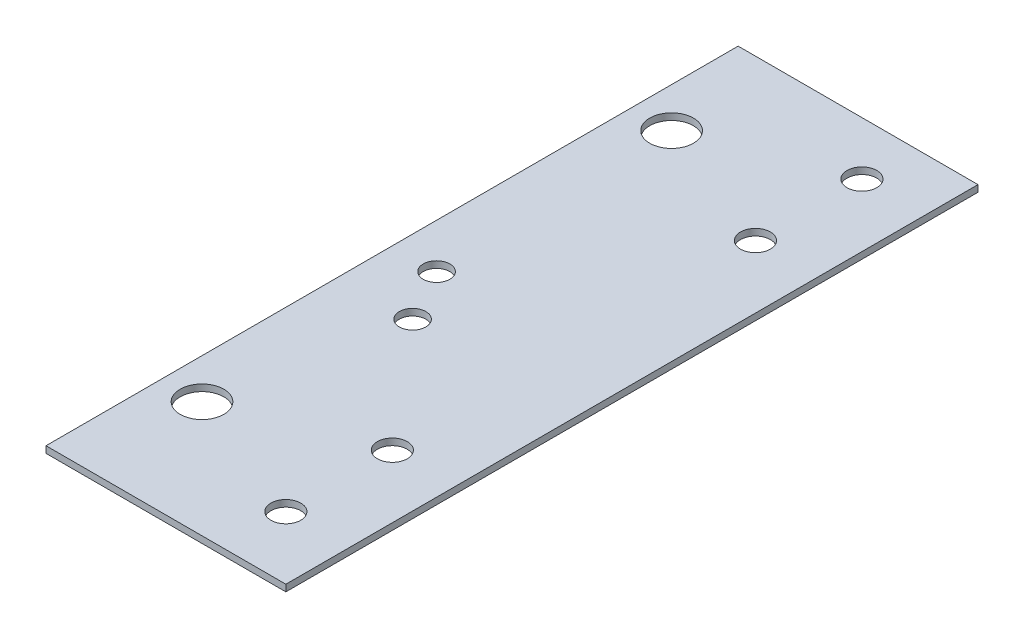
ISO-10303-21;
HEADER;
FILE_DESCRIPTION(('STEP AP214'),'2;1');
FILE_NAME('part.step','',(''),(''),'','','');
FILE_SCHEMA(('AUTOMOTIVE_DESIGN { 1 0 10303 214 1 1 1 1 }'));
ENDSEC;
DATA;
#1=APPLICATION_CONTEXT('core data for automotive mechanical design processes');
#2=APPLICATION_PROTOCOL_DEFINITION('international standard','automotive_design',2000,#1);
#3=PRODUCT_CONTEXT('',#1,'mechanical');
#4=PRODUCT('Part','Part','',(#3));
#5=PRODUCT_RELATED_PRODUCT_CATEGORY('part','',(#4));
#6=PRODUCT_DEFINITION_FORMATION('','',#4);
#7=PRODUCT_DEFINITION_CONTEXT('part definition',#1,'design');
#8=PRODUCT_DEFINITION('design','',#6,#7);
#9=PRODUCT_DEFINITION_SHAPE('','',#8);
#10=(LENGTH_UNIT() NAMED_UNIT(*) SI_UNIT(.MILLI.,.METRE.));
#11=(NAMED_UNIT(*) PLANE_ANGLE_UNIT() SI_UNIT($,.RADIAN.));
#12=(NAMED_UNIT(*) SI_UNIT($,.STERADIAN.) SOLID_ANGLE_UNIT());
#13=UNCERTAINTY_MEASURE_WITH_UNIT(LENGTH_MEASURE(1.E-05),#10,'distance_accuracy_value','');
#14=(GEOMETRIC_REPRESENTATION_CONTEXT(3) GLOBAL_UNCERTAINTY_ASSIGNED_CONTEXT((#13)) GLOBAL_UNIT_ASSIGNED_CONTEXT((#10,
#11,#12)) REPRESENTATION_CONTEXT('',''));
#15=CARTESIAN_POINT('',(0.,0.,0.));
#16=DIRECTION('',(0.,0.,1.));
#17=DIRECTION('',(1.,0.,0.));
#18=AXIS2_PLACEMENT_3D('',#15,#16,#17);
#19=CARTESIAN_POINT('',(0.,1.5875,0.));
#20=DIRECTION('',(0.,-1.,0.));
#21=DIRECTION('',(0.,0.,-1.));
#22=AXIS2_PLACEMENT_3D('',#19,#20,#21);
#23=PLANE('',#22);
#24=CARTESIAN_POINT('',(-11.01725,1.5875,13.843));
#25=DIRECTION('',(0.,-1.,0.));
#26=DIRECTION('',(0.,0.,-1.));
#27=AXIS2_PLACEMENT_3D('',#24,#25,#26);
#28=CIRCLE('',#27,3.175);
#29=CARTESIAN_POINT('',(-11.01725,1.5875,10.668));
#30=VERTEX_POINT('',#29);
#31=EDGE_CURVE('E318',#30,#30,#28,.T.);
#32=ORIENTED_EDGE('',*,*,#31,.T.);
#33=EDGE_LOOP('',(#32));
#34=FACE_BOUND('',#33,.T.);
#35=CARTESIAN_POINT('',(-17.992815678,1.5875,1.143));
#36=DIRECTION('',(0.,1.,0.));
#37=DIRECTION('',(0.,0.,1.));
#38=AXIS2_PLACEMENT_3D('',#35,#36,#37);
#39=CIRCLE('',#38,3.175);
#40=CARTESIAN_POINT('',(-17.992815678,1.5875,4.318));
#41=VERTEX_POINT('',#40);
#42=EDGE_CURVE('E136',#41,#41,#39,.T.);
#43=ORIENTED_EDGE('',*,*,#42,.F.);
#44=EDGE_LOOP('',(#43));
#45=FACE_BOUND('',#44,.T.);
#46=DIRECTION('',(0.,0.,-1.));
#47=VECTOR('',#46,1.);
#48=CARTESIAN_POINT('',(28.60675,1.5875,83.693));
#49=LINE('',#48,#47);
#50=CARTESIAN_POINT('',(28.60675,1.5875,83.693));
#51=VERTEX_POINT('',#50);
#52=CARTESIAN_POINT('',(28.60675,1.5875,-81.407));
#53=VERTEX_POINT('',#52);
#54=EDGE_CURVE('E82',#51,#53,#49,.T.);
#55=ORIENTED_EDGE('',*,*,#54,.T.);
#56=DIRECTION('',(-1.,0.,0.));
#57=VECTOR('',#56,1.);
#58=CARTESIAN_POINT('',(-28.60675,1.5875,-81.407));
#59=LINE('',#58,#57);
#60=CARTESIAN_POINT('',(-28.60675,1.5875,-81.407));
#61=VERTEX_POINT('',#60);
#62=EDGE_CURVE('E85',#53,#61,#59,.T.);
#63=ORIENTED_EDGE('',*,*,#62,.T.);
#64=DIRECTION('',(0.,0.,1.));
#65=VECTOR('',#64,1.);
#66=CARTESIAN_POINT('',(-28.60675,1.5875,-81.407));
#67=LINE('',#66,#65);
#68=CARTESIAN_POINT('',(-28.60675,1.5875,83.693));
#69=VERTEX_POINT('',#68);
#70=EDGE_CURVE('E89',#61,#69,#67,.T.);
#71=ORIENTED_EDGE('',*,*,#70,.T.);
#72=DIRECTION('',(1.,0.,0.));
#73=VECTOR('',#72,1.);
#74=CARTESIAN_POINT('',(-28.60675,1.5875,83.693));
#75=LINE('',#74,#73);
#76=EDGE_CURVE('E54',#69,#51,#75,.T.);
#77=ORIENTED_EDGE('',*,*,#76,.T.);
#78=EDGE_LOOP('',(#55,#63,#71,#77));
#79=FACE_BOUND('',#78,.T.);
#80=CARTESIAN_POINT('',(-19.08175,1.5875,-56.007));
#81=DIRECTION('',(0.,1.,0.));
#82=DIRECTION('',(0.,0.,1.));
#83=AXIS2_PLACEMENT_3D('',#80,#81,#82);
#84=CIRCLE('',#83,5.207);
#85=CARTESIAN_POINT('',(-19.08175,1.5875,-50.8));
#86=VERTEX_POINT('',#85);
#87=EDGE_CURVE('E103',#86,#86,#84,.T.);
#88=ORIENTED_EDGE('',*,*,#87,.F.);
#89=EDGE_LOOP('',(#88));
#90=FACE_BOUND('',#89,.T.);
#91=CARTESIAN_POINT('',(-19.08175,1.5875,56.007));
#92=DIRECTION('',(0.,1.,0.));
#93=DIRECTION('',(0.,0.,1.));
#94=AXIS2_PLACEMENT_3D('',#91,#92,#93);
#95=CIRCLE('',#94,5.207);
#96=CARTESIAN_POINT('',(-19.08175,1.5875,61.214));
#97=VERTEX_POINT('',#96);
#98=EDGE_CURVE('E155',#97,#97,#95,.T.);
#99=ORIENTED_EDGE('',*,*,#98,.F.);
#100=EDGE_LOOP('',(#99));
#101=FACE_BOUND('',#100,.T.);
#102=CARTESIAN_POINT('',(13.62075,1.5875,-68.707));
#103=DIRECTION('',(0.,1.,0.));
#104=DIRECTION('',(0.,0.,1.));
#105=AXIS2_PLACEMENT_3D('',#102,#103,#104);
#106=CIRCLE('',#105,3.55600000000001);
#107=CARTESIAN_POINT('',(13.62075,1.5875,-65.151));
#108=VERTEX_POINT('',#107);
#109=EDGE_CURVE('E150',#108,#108,#106,.T.);
#110=ORIENTED_EDGE('',*,*,#109,.F.);
#111=EDGE_LOOP('',(#110));
#112=FACE_BOUND('',#111,.T.);
#113=CARTESIAN_POINT('',(13.62075,1.5875,-43.307));
#114=DIRECTION('',(0.,1.,0.));
#115=DIRECTION('',(0.,0.,1.));
#116=AXIS2_PLACEMENT_3D('',#113,#114,#115);
#117=CIRCLE('',#116,3.55600000000001);
#118=CARTESIAN_POINT('',(13.62075,1.5875,-39.751));
#119=VERTEX_POINT('',#118);
#120=EDGE_CURVE('E145',#119,#119,#117,.T.);
#121=ORIENTED_EDGE('',*,*,#120,.F.);
#122=EDGE_LOOP('',(#121));
#123=FACE_BOUND('',#122,.T.);
#124=CARTESIAN_POINT('',(13.62075,1.5875,43.307));
#125=DIRECTION('',(0.,1.,0.));
#126=DIRECTION('',(0.,0.,1.));
#127=AXIS2_PLACEMENT_3D('',#124,#125,#126);
#128=CIRCLE('',#127,3.55600000000001);
#129=CARTESIAN_POINT('',(13.62075,1.5875,46.863));
#130=VERTEX_POINT('',#129);
#131=EDGE_CURVE('E140',#130,#130,#128,.T.);
#132=ORIENTED_EDGE('',*,*,#131,.F.);
#133=EDGE_LOOP('',(#132));
#134=FACE_BOUND('',#133,.T.);
#135=CARTESIAN_POINT('',(13.62075,1.5875,68.707));
#136=DIRECTION('',(0.,1.,0.));
#137=DIRECTION('',(0.,0.,1.));
#138=AXIS2_PLACEMENT_3D('',#135,#136,#137);
#139=CIRCLE('',#138,3.55600000000001);
#140=CARTESIAN_POINT('',(13.62075,1.5875,72.263));
#141=VERTEX_POINT('',#140);
#142=EDGE_CURVE('E129',#141,#141,#139,.T.);
#143=ORIENTED_EDGE('',*,*,#142,.F.);
#144=EDGE_LOOP('',(#143));
#145=FACE_BOUND('',#144,.T.);
#146=ADVANCED_FACE('F37',(#34,#45,#79,#90,#101,#112,#123,#134,#145),#23,.F.);
#147=CARTESIAN_POINT('',(0.,0.,0.));
#148=DIRECTION('',(0.,-1.,0.));
#149=DIRECTION('',(0.,0.,-1.));
#150=AXIS2_PLACEMENT_3D('',#147,#148,#149);
#151=PLANE('',#150);
#152=CARTESIAN_POINT('',(-11.01725,0.,13.843));
#153=DIRECTION('',(0.,-1.,0.));
#154=DIRECTION('',(0.,0.,-1.));
#155=AXIS2_PLACEMENT_3D('',#152,#153,#154);
#156=CIRCLE('',#155,3.175);
#157=CARTESIAN_POINT('',(-11.01725,0.,10.668));
#158=VERTEX_POINT('',#157);
#159=EDGE_CURVE('E319',#158,#158,#156,.T.);
#160=ORIENTED_EDGE('',*,*,#159,.F.);
#161=EDGE_LOOP('',(#160));
#162=FACE_BOUND('',#161,.T.);
#163=CARTESIAN_POINT('',(-17.992815678,0.,1.143));
#164=DIRECTION('',(0.,1.,0.));
#165=DIRECTION('',(0.,0.,1.));
#166=AXIS2_PLACEMENT_3D('',#163,#164,#165);
#167=CIRCLE('',#166,3.175);
#168=CARTESIAN_POINT('',(-17.992815678,0.,4.318));
#169=VERTEX_POINT('',#168);
#170=EDGE_CURVE('E130',#169,#169,#167,.T.);
#171=ORIENTED_EDGE('',*,*,#170,.T.);
#172=EDGE_LOOP('',(#171));
#173=FACE_BOUND('',#172,.T.);
#174=CARTESIAN_POINT('',(13.62075,0.,43.307));
#175=DIRECTION('',(0.,1.,0.));
#176=DIRECTION('',(0.,0.,1.));
#177=AXIS2_PLACEMENT_3D('',#174,#175,#176);
#178=CIRCLE('',#177,3.55600000000001);
#179=CARTESIAN_POINT('',(13.62075,0.,46.863));
#180=VERTEX_POINT('',#179);
#181=EDGE_CURVE('E133',#180,#180,#178,.T.);
#182=ORIENTED_EDGE('',*,*,#181,.T.);
#183=EDGE_LOOP('',(#182));
#184=FACE_BOUND('',#183,.T.);
#185=CARTESIAN_POINT('',(13.62075,0.,-68.707));
#186=DIRECTION('',(0.,1.,0.));
#187=DIRECTION('',(0.,0.,1.));
#188=AXIS2_PLACEMENT_3D('',#185,#186,#187);
#189=CIRCLE('',#188,3.55600000000001);
#190=CARTESIAN_POINT('',(13.62075,0.,-65.151));
#191=VERTEX_POINT('',#190);
#192=EDGE_CURVE('E148',#191,#191,#189,.T.);
#193=ORIENTED_EDGE('',*,*,#192,.T.);
#194=EDGE_LOOP('',(#193));
#195=FACE_BOUND('',#194,.T.);
#196=CARTESIAN_POINT('',(-19.08175,0.,-56.007));
#197=DIRECTION('',(0.,1.,0.));
#198=DIRECTION('',(0.,0.,1.));
#199=AXIS2_PLACEMENT_3D('',#196,#197,#198);
#200=CIRCLE('',#199,5.207);
#201=CARTESIAN_POINT('',(-19.08175,0.,-50.8));
#202=VERTEX_POINT('',#201);
#203=EDGE_CURVE('E158',#202,#202,#200,.T.);
#204=ORIENTED_EDGE('',*,*,#203,.T.);
#205=EDGE_LOOP('',(#204));
#206=FACE_BOUND('',#205,.T.);
#207=DIRECTION('',(0.,0.,-1.));
#208=VECTOR('',#207,1.);
#209=CARTESIAN_POINT('',(28.60675,0.,-81.407));
#210=LINE('',#209,#208);
#211=CARTESIAN_POINT('',(28.60675,0.,83.693));
#212=VERTEX_POINT('',#211);
#213=CARTESIAN_POINT('',(28.60675,0.,-81.407));
#214=VERTEX_POINT('',#213);
#215=EDGE_CURVE('E77',#212,#214,#210,.T.);
#216=ORIENTED_EDGE('',*,*,#215,.F.);
#217=DIRECTION('',(1.,0.,0.));
#218=VECTOR('',#217,1.);
#219=CARTESIAN_POINT('',(-28.60675,0.,83.693));
#220=LINE('',#219,#218);
#221=CARTESIAN_POINT('',(-28.60675,0.,83.693));
#222=VERTEX_POINT('',#221);
#223=EDGE_CURVE('E106',#222,#212,#220,.T.);
#224=ORIENTED_EDGE('',*,*,#223,.F.);
#225=DIRECTION('',(0.,0.,1.));
#226=VECTOR('',#225,1.);
#227=CARTESIAN_POINT('',(-28.60675,0.,81.407));
#228=LINE('',#227,#226);
#229=CARTESIAN_POINT('',(-28.60675,0.,-81.407));
#230=VERTEX_POINT('',#229);
#231=EDGE_CURVE('E70',#230,#222,#228,.T.);
#232=ORIENTED_EDGE('',*,*,#231,.F.);
#233=DIRECTION('',(-1.,0.,0.));
#234=VECTOR('',#233,1.);
#235=CARTESIAN_POINT('',(-28.60675,0.,-81.407));
#236=LINE('',#235,#234);
#237=EDGE_CURVE('E94',#214,#230,#236,.T.);
#238=ORIENTED_EDGE('',*,*,#237,.F.);
#239=EDGE_LOOP('',(#216,#224,#232,#238));
#240=FACE_BOUND('',#239,.T.);
#241=CARTESIAN_POINT('',(-19.08175,0.,56.007));
#242=DIRECTION('',(0.,1.,0.));
#243=DIRECTION('',(0.,0.,1.));
#244=AXIS2_PLACEMENT_3D('',#241,#242,#243);
#245=CIRCLE('',#244,5.207);
#246=CARTESIAN_POINT('',(-19.08175,0.,61.214));
#247=VERTEX_POINT('',#246);
#248=EDGE_CURVE('E120',#247,#247,#245,.T.);
#249=ORIENTED_EDGE('',*,*,#248,.T.);
#250=EDGE_LOOP('',(#249));
#251=FACE_BOUND('',#250,.T.);
#252=CARTESIAN_POINT('',(13.62075,0.,-43.307));
#253=DIRECTION('',(0.,1.,0.));
#254=DIRECTION('',(0.,0.,1.));
#255=AXIS2_PLACEMENT_3D('',#252,#253,#254);
#256=CIRCLE('',#255,3.55600000000001);
#257=CARTESIAN_POINT('',(13.62075,0.,-39.751));
#258=VERTEX_POINT('',#257);
#259=EDGE_CURVE('E124',#258,#258,#256,.T.);
#260=ORIENTED_EDGE('',*,*,#259,.T.);
#261=EDGE_LOOP('',(#260));
#262=FACE_BOUND('',#261,.T.);
#263=CARTESIAN_POINT('',(13.62075,0.,68.707));
#264=DIRECTION('',(0.,1.,0.));
#265=DIRECTION('',(0.,0.,1.));
#266=AXIS2_PLACEMENT_3D('',#263,#264,#265);
#267=CIRCLE('',#266,3.55600000000001);
#268=CARTESIAN_POINT('',(13.62075,0.,72.263));
#269=VERTEX_POINT('',#268);
#270=EDGE_CURVE('E127',#269,#269,#267,.T.);
#271=ORIENTED_EDGE('',*,*,#270,.T.);
#272=EDGE_LOOP('',(#271));
#273=FACE_BOUND('',#272,.T.);
#274=ADVANCED_FACE('F112',(#162,#173,#184,#195,#206,#240,#251,#262,#273),#151,.T.);
#275=CARTESIAN_POINT('',(28.60675,1.5875,-81.407));
#276=DIRECTION('',(-1.,0.,0.));
#277=DIRECTION('',(0.,0.,1.));
#278=AXIS2_PLACEMENT_3D('',#275,#276,#277);
#279=PLANE('',#278);
#280=ORIENTED_EDGE('',*,*,#215,.T.);
#281=DIRECTION('',(0.,-1.,0.));
#282=VECTOR('',#281,1.);
#283=CARTESIAN_POINT('',(28.60675,1.5875,-81.407));
#284=LINE('',#283,#282);
#285=EDGE_CURVE('E11',#53,#214,#284,.T.);
#286=ORIENTED_EDGE('',*,*,#285,.F.);
#287=ORIENTED_EDGE('',*,*,#54,.F.);
#288=DIRECTION('',(0.,-1.,0.));
#289=VECTOR('',#288,1.);
#290=CARTESIAN_POINT('',(28.60675,1.5875,83.693));
#291=LINE('',#290,#289);
#292=EDGE_CURVE('E98',#51,#212,#291,.T.);
#293=ORIENTED_EDGE('',*,*,#292,.T.);
#294=EDGE_LOOP('',(#280,#286,#287,#293));
#295=FACE_BOUND('',#294,.T.);
#296=ADVANCED_FACE('F39',(#295),#279,.F.);
#297=CARTESIAN_POINT('',(-28.60675,1.5875,-81.407));
#298=DIRECTION('',(0.,0.,1.));
#299=DIRECTION('',(1.,0.,0.));
#300=AXIS2_PLACEMENT_3D('',#297,#298,#299);
#301=PLANE('',#300);
#302=ORIENTED_EDGE('',*,*,#237,.T.);
#303=DIRECTION('',(0.,-1.,0.));
#304=VECTOR('',#303,1.);
#305=CARTESIAN_POINT('',(-28.60675,1.5875,-81.407));
#306=LINE('',#305,#304);
#307=EDGE_CURVE('E46',#61,#230,#306,.T.);
#308=ORIENTED_EDGE('',*,*,#307,.F.);
#309=ORIENTED_EDGE('',*,*,#62,.F.);
#310=ORIENTED_EDGE('',*,*,#285,.T.);
#311=EDGE_LOOP('',(#302,#308,#309,#310));
#312=FACE_BOUND('',#311,.T.);
#313=ADVANCED_FACE('F93',(#312),#301,.F.);
#314=CARTESIAN_POINT('',(-28.60675,1.5875,81.407));
#315=DIRECTION('',(1.,0.,0.));
#316=DIRECTION('',(0.,0.,-1.));
#317=AXIS2_PLACEMENT_3D('',#314,#315,#316);
#318=PLANE('',#317);
#319=ORIENTED_EDGE('',*,*,#231,.T.);
#320=DIRECTION('',(0.,-1.,0.));
#321=VECTOR('',#320,1.);
#322=CARTESIAN_POINT('',(-28.60675,1.5875,83.693));
#323=LINE('',#322,#321);
#324=EDGE_CURVE('E95',#69,#222,#323,.T.);
#325=ORIENTED_EDGE('',*,*,#324,.F.);
#326=ORIENTED_EDGE('',*,*,#70,.F.);
#327=ORIENTED_EDGE('',*,*,#307,.T.);
#328=EDGE_LOOP('',(#319,#325,#326,#327));
#329=FACE_BOUND('',#328,.T.);
#330=ADVANCED_FACE('F96',(#329),#318,.F.);
#331=CARTESIAN_POINT('',(-28.60675,1.5875,83.693));
#332=DIRECTION('',(0.,0.,-1.));
#333=DIRECTION('',(-1.,0.,0.));
#334=AXIS2_PLACEMENT_3D('',#331,#332,#333);
#335=PLANE('',#334);
#336=ORIENTED_EDGE('',*,*,#223,.T.);
#337=ORIENTED_EDGE('',*,*,#292,.F.);
#338=ORIENTED_EDGE('',*,*,#76,.F.);
#339=ORIENTED_EDGE('',*,*,#324,.T.);
#340=EDGE_LOOP('',(#336,#337,#338,#339));
#341=FACE_BOUND('',#340,.T.);
#342=ADVANCED_FACE('F111',(#341),#335,.F.);
#343=CARTESIAN_POINT('',(-19.08175,1.5875,-56.007));
#344=DIRECTION('',(0.,-1.,0.));
#345=DIRECTION('',(0.,0.,-1.));
#346=AXIS2_PLACEMENT_3D('',#343,#344,#345);
#347=CYLINDRICAL_SURFACE('',#346,5.207);
#348=ORIENTED_EDGE('',*,*,#87,.T.);
#349=EDGE_LOOP('',(#348));
#350=FACE_BOUND('',#349,.T.);
#351=ORIENTED_EDGE('',*,*,#203,.F.);
#352=EDGE_LOOP('',(#351));
#353=FACE_BOUND('',#352,.T.);
#354=ADVANCED_FACE('F166',(#350,#353),#347,.F.);
#355=CARTESIAN_POINT('',(-19.08175,1.5875,56.007));
#356=DIRECTION('',(0.,-1.,0.));
#357=DIRECTION('',(0.,0.,-1.));
#358=AXIS2_PLACEMENT_3D('',#355,#356,#357);
#359=CYLINDRICAL_SURFACE('',#358,5.207);
#360=ORIENTED_EDGE('',*,*,#98,.T.);
#361=EDGE_LOOP('',(#360));
#362=FACE_BOUND('',#361,.T.);
#363=ORIENTED_EDGE('',*,*,#248,.F.);
#364=EDGE_LOOP('',(#363));
#365=FACE_BOUND('',#364,.T.);
#366=ADVANCED_FACE('F168',(#362,#365),#359,.F.);
#367=CARTESIAN_POINT('',(13.62075,1.5875,-68.707));
#368=DIRECTION('',(0.,-1.,0.));
#369=DIRECTION('',(0.,0.,-1.));
#370=AXIS2_PLACEMENT_3D('',#367,#368,#369);
#371=CYLINDRICAL_SURFACE('',#370,3.55600000000001);
#372=ORIENTED_EDGE('',*,*,#109,.T.);
#373=EDGE_LOOP('',(#372));
#374=FACE_BOUND('',#373,.T.);
#375=ORIENTED_EDGE('',*,*,#192,.F.);
#376=EDGE_LOOP('',(#375));
#377=FACE_BOUND('',#376,.T.);
#378=ADVANCED_FACE('F175',(#374,#377),#371,.F.);
#379=CARTESIAN_POINT('',(13.62075,1.5875,-43.307));
#380=DIRECTION('',(0.,-1.,0.));
#381=DIRECTION('',(0.,0.,-1.));
#382=AXIS2_PLACEMENT_3D('',#379,#380,#381);
#383=CYLINDRICAL_SURFACE('',#382,3.55600000000001);
#384=ORIENTED_EDGE('',*,*,#120,.T.);
#385=EDGE_LOOP('',(#384));
#386=FACE_BOUND('',#385,.T.);
#387=ORIENTED_EDGE('',*,*,#259,.F.);
#388=EDGE_LOOP('',(#387));
#389=FACE_BOUND('',#388,.T.);
#390=ADVANCED_FACE('F238',(#386,#389),#383,.F.);
#391=CARTESIAN_POINT('',(13.62075,1.5875,43.307));
#392=DIRECTION('',(0.,-1.,0.));
#393=DIRECTION('',(0.,0.,-1.));
#394=AXIS2_PLACEMENT_3D('',#391,#392,#393);
#395=CYLINDRICAL_SURFACE('',#394,3.55600000000001);
#396=ORIENTED_EDGE('',*,*,#131,.T.);
#397=EDGE_LOOP('',(#396));
#398=FACE_BOUND('',#397,.T.);
#399=ORIENTED_EDGE('',*,*,#181,.F.);
#400=EDGE_LOOP('',(#399));
#401=FACE_BOUND('',#400,.T.);
#402=ADVANCED_FACE('F230',(#398,#401),#395,.F.);
#403=CARTESIAN_POINT('',(13.62075,1.5875,68.707));
#404=DIRECTION('',(0.,-1.,0.));
#405=DIRECTION('',(0.,0.,-1.));
#406=AXIS2_PLACEMENT_3D('',#403,#404,#405);
#407=CYLINDRICAL_SURFACE('',#406,3.55600000000001);
#408=ORIENTED_EDGE('',*,*,#142,.T.);
#409=EDGE_LOOP('',(#408));
#410=FACE_BOUND('',#409,.T.);
#411=ORIENTED_EDGE('',*,*,#270,.F.);
#412=EDGE_LOOP('',(#411));
#413=FACE_BOUND('',#412,.T.);
#414=ADVANCED_FACE('F223',(#410,#413),#407,.F.);
#415=CARTESIAN_POINT('',(-17.992815678,0.,1.143));
#416=DIRECTION('',(0.,1.,0.));
#417=DIRECTION('',(0.,0.,1.));
#418=AXIS2_PLACEMENT_3D('',#415,#416,#417);
#419=CYLINDRICAL_SURFACE('',#418,3.175);
#420=ORIENTED_EDGE('',*,*,#170,.F.);
#421=EDGE_LOOP('',(#420));
#422=FACE_BOUND('',#421,.T.);
#423=ORIENTED_EDGE('',*,*,#42,.T.);
#424=EDGE_LOOP('',(#423));
#425=FACE_BOUND('',#424,.T.);
#426=ADVANCED_FACE('F213',(#422,#425),#419,.F.);
#427=CARTESIAN_POINT('',(-11.01725,1.5875,13.843));
#428=DIRECTION('',(0.,-1.,0.));
#429=DIRECTION('',(0.,0.,-1.));
#430=AXIS2_PLACEMENT_3D('',#427,#428,#429);
#431=CYLINDRICAL_SURFACE('',#430,3.175);
#432=ORIENTED_EDGE('',*,*,#31,.F.);
#433=EDGE_LOOP('',(#432));
#434=FACE_BOUND('',#433,.T.);
#435=ORIENTED_EDGE('',*,*,#159,.T.);
#436=EDGE_LOOP('',(#435));
#437=FACE_BOUND('',#436,.T.);
#438=ADVANCED_FACE('F209',(#434,#437),#431,.F.);
#439=CLOSED_SHELL('',(#146,#274,#296,#313,#330,#342,#354,#366,#378,#390,#402,#414,#426,#438));
#440=MANIFOLD_SOLID_BREP('B2',#439);
#441=ADVANCED_BREP_SHAPE_REPRESENTATION('',(#18,#440),#14);
#442=SHAPE_DEFINITION_REPRESENTATION(#9,#441);
ENDSEC;
END-ISO-10303-21;
